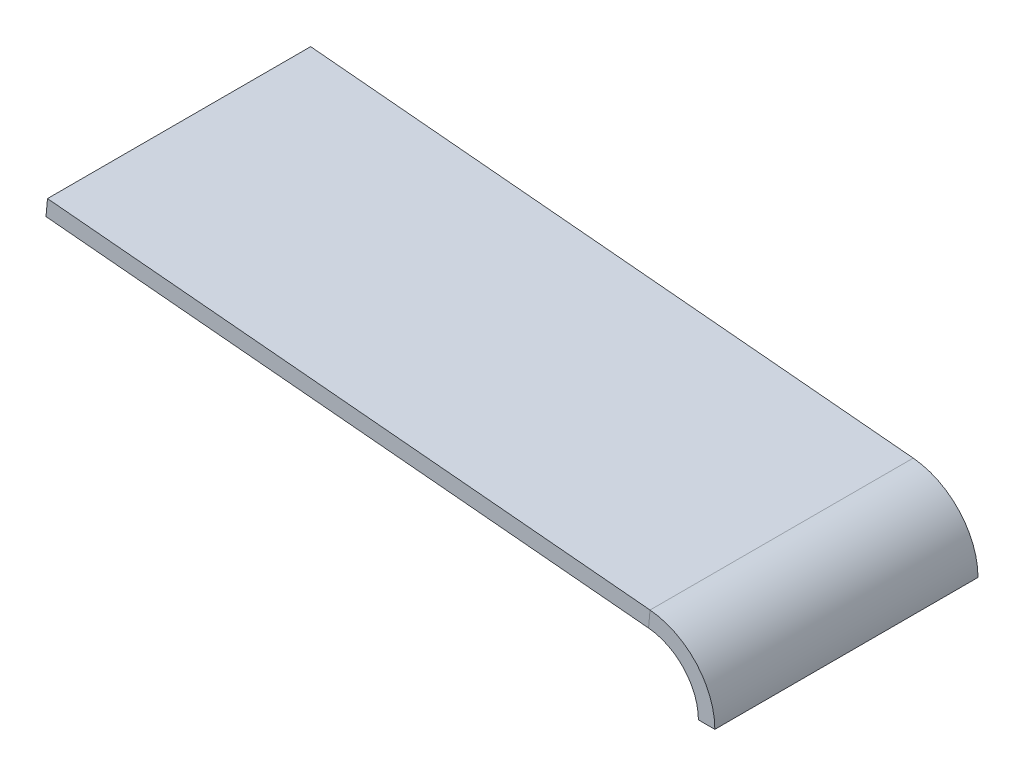
ISO-10303-21;
HEADER;
FILE_DESCRIPTION(('STEP AP214'),'2;1');
FILE_NAME('part.step','',(''),(''),'','','');
FILE_SCHEMA(('AUTOMOTIVE_DESIGN { 1 0 10303 214 1 1 1 1 }'));
ENDSEC;
DATA;
#1=APPLICATION_CONTEXT('core data for automotive mechanical design processes');
#2=APPLICATION_PROTOCOL_DEFINITION('international standard','automotive_design',2000,#1);
#3=PRODUCT_CONTEXT('',#1,'mechanical');
#4=PRODUCT('Part','Part','',(#3));
#5=PRODUCT_RELATED_PRODUCT_CATEGORY('part','',(#4));
#6=PRODUCT_DEFINITION_FORMATION('','',#4);
#7=PRODUCT_DEFINITION_CONTEXT('part definition',#1,'design');
#8=PRODUCT_DEFINITION('design','',#6,#7);
#9=PRODUCT_DEFINITION_SHAPE('','',#8);
#10=(LENGTH_UNIT() NAMED_UNIT(*) SI_UNIT(.MILLI.,.METRE.));
#11=(NAMED_UNIT(*) PLANE_ANGLE_UNIT() SI_UNIT($,.RADIAN.));
#12=(NAMED_UNIT(*) SI_UNIT($,.STERADIAN.) SOLID_ANGLE_UNIT());
#13=UNCERTAINTY_MEASURE_WITH_UNIT(LENGTH_MEASURE(1.E-05),#10,'distance_accuracy_value','');
#14=(GEOMETRIC_REPRESENTATION_CONTEXT(3) GLOBAL_UNCERTAINTY_ASSIGNED_CONTEXT((#13)) GLOBAL_UNIT_ASSIGNED_CONTEXT((#10,
#11,#12)) REPRESENTATION_CONTEXT('',''));
#15=CARTESIAN_POINT('',(0.,0.,0.));
#16=DIRECTION('',(0.,0.,1.));
#17=DIRECTION('',(1.,0.,0.));
#18=AXIS2_PLACEMENT_3D('',#15,#16,#17);
#19=CARTESIAN_POINT('',(3.31543524806376,2.89585211302469,-0.5));
#20=DIRECTION('',(0.,0.,1.));
#21=DIRECTION('',(1.,0.,0.));
#22=AXIS2_PLACEMENT_3D('',#19,#20,#21);
#23=PLANE('',#22);
#24=DIRECTION('',(0.0909866417901827,0.995852113024693,0.));
#25=VECTOR('',#24,1.);
#26=CARTESIAN_POINT('',(3.31543524806376,2.89585211302469,-0.5));
#27=LINE('',#26,#25);
#28=CARTESIAN_POINT('',(3.31543524806376,2.89585211302469,-0.5));
#29=VERTEX_POINT('',#28);
#30=CARTESIAN_POINT('',(3.34273124060081,3.1946077469321,-0.5));
#31=VERTEX_POINT('',#30);
#32=EDGE_CURVE('E11',#29,#31,#27,.T.);
#33=ORIENTED_EDGE('',*,*,#32,.F.);
#34=CARTESIAN_POINT('',(3.22444860627358,1.9,-0.5));
#35=DIRECTION('',(0.,0.,1.));
#36=DIRECTION('',(1.,0.,0.));
#37=AXIS2_PLACEMENT_3D('',#34,#35,#36);
#38=CIRCLE('',#37,1.);
#39=CARTESIAN_POINT('',(4.22444860627359,1.9,-0.5));
#40=VERTEX_POINT('',#39);
#41=EDGE_CURVE('E128',#40,#29,#38,.T.);
#42=ORIENTED_EDGE('',*,*,#41,.F.);
#43=DIRECTION('',(-1.,0.,0.));
#44=VECTOR('',#43,1.);
#45=CARTESIAN_POINT('',(4.52444860627359,1.9,-0.5));
#46=LINE('',#45,#44);
#47=CARTESIAN_POINT('',(4.52444860627359,1.9,-0.5));
#48=VERTEX_POINT('',#47);
#49=EDGE_CURVE('E131',#48,#40,#46,.T.);
#50=ORIENTED_EDGE('',*,*,#49,.F.);
#51=CARTESIAN_POINT('',(3.22444860627358,1.9,-0.5));
#52=DIRECTION('',(0.,0.,1.));
#53=DIRECTION('',(1.,0.,0.));
#54=AXIS2_PLACEMENT_3D('',#51,#52,#53);
#55=CIRCLE('',#54,1.3);
#56=EDGE_CURVE('E133',#48,#31,#55,.T.);
#57=ORIENTED_EDGE('',*,*,#56,.T.);
#58=EDGE_LOOP('',(#33,#42,#50,#57));
#59=FACE_BOUND('',#58,.T.);
#60=ADVANCED_FACE('F35',(#59),#23,.T.);
#61=CARTESIAN_POINT('',(3.34273124060081,3.1946077469321,-5.3));
#62=DIRECTION('',(0.,0.,-1.));
#63=DIRECTION('',(-1.,0.,0.));
#64=AXIS2_PLACEMENT_3D('',#61,#62,#63);
#65=PLANE('',#64);
#66=DIRECTION('',(-0.0909866417901827,-0.995852113024693,0.));
#67=VECTOR('',#66,1.);
#68=CARTESIAN_POINT('',(3.34273124060081,3.1946077469321,-5.3));
#69=LINE('',#68,#67);
#70=CARTESIAN_POINT('',(3.34273124060081,3.1946077469321,-5.3));
#71=VERTEX_POINT('',#70);
#72=CARTESIAN_POINT('',(3.31543524806376,2.89585211302469,-5.3));
#73=VERTEX_POINT('',#72);
#74=EDGE_CURVE('E42',#71,#73,#69,.T.);
#75=ORIENTED_EDGE('',*,*,#74,.F.);
#76=CARTESIAN_POINT('',(3.22444860627358,1.9,-5.3));
#77=DIRECTION('',(0.,0.,1.));
#78=DIRECTION('',(1.,0.,0.));
#79=AXIS2_PLACEMENT_3D('',#76,#77,#78);
#80=CIRCLE('',#79,1.3);
#81=CARTESIAN_POINT('',(4.52444860627359,1.9,-5.3));
#82=VERTEX_POINT('',#81);
#83=EDGE_CURVE('E120',#82,#71,#80,.T.);
#84=ORIENTED_EDGE('',*,*,#83,.F.);
#85=DIRECTION('',(-1.,0.,0.));
#86=VECTOR('',#85,1.);
#87=CARTESIAN_POINT('',(4.52444860627359,1.9,-5.3));
#88=LINE('',#87,#86);
#89=CARTESIAN_POINT('',(4.22444860627359,1.9,-5.3));
#90=VERTEX_POINT('',#89);
#91=EDGE_CURVE('E117',#82,#90,#88,.T.);
#92=ORIENTED_EDGE('',*,*,#91,.T.);
#93=CARTESIAN_POINT('',(3.22444860627358,1.9,-5.3));
#94=DIRECTION('',(0.,0.,1.));
#95=DIRECTION('',(1.,0.,0.));
#96=AXIS2_PLACEMENT_3D('',#93,#94,#95);
#97=CIRCLE('',#96,1.);
#98=EDGE_CURVE('E114',#90,#73,#97,.T.);
#99=ORIENTED_EDGE('',*,*,#98,.T.);
#100=EDGE_LOOP('',(#75,#84,#92,#99));
#101=FACE_BOUND('',#100,.T.);
#102=ADVANCED_FACE('F150',(#101),#65,.T.);
#103=CARTESIAN_POINT('',(-7.64770400746295,4.19875563390741,-0.5));
#104=DIRECTION('',(-0.0909866417901704,-0.995852113024694,0.));
#105=DIRECTION('',(0.995852113024694,-0.0909866417901704,0.));
#106=AXIS2_PLACEMENT_3D('',#103,#104,#105);
#107=PLANE('',#106);
#108=DIRECTION('',(0.,0.,-1.));
#109=VECTOR('',#108,1.);
#110=CARTESIAN_POINT('',(3.34273124060081,3.1946077469321,-0.5));
#111=LINE('',#110,#109);
#112=EDGE_CURVE('E110',#31,#71,#111,.T.);
#113=ORIENTED_EDGE('',*,*,#112,.T.);
#114=DIRECTION('',(-0.995852113024694,0.0909866417901704,0.));
#115=VECTOR('',#114,1.);
#116=CARTESIAN_POINT('',(-7.64770400746295,4.19875563390741,-5.3));
#117=LINE('',#116,#115);
#118=CARTESIAN_POINT('',(-7.64770400746295,4.19875563390741,-5.3));
#119=VERTEX_POINT('',#118);
#120=EDGE_CURVE('E102',#71,#119,#117,.T.);
#121=ORIENTED_EDGE('',*,*,#120,.T.);
#122=DIRECTION('',(0.,0.,-1.));
#123=VECTOR('',#122,1.);
#124=CARTESIAN_POINT('',(-7.64770400746295,4.19875563390741,-0.5));
#125=LINE('',#124,#123);
#126=CARTESIAN_POINT('',(-7.64770400746295,4.19875563390741,-0.5));
#127=VERTEX_POINT('',#126);
#128=EDGE_CURVE('E87',#127,#119,#125,.T.);
#129=ORIENTED_EDGE('',*,*,#128,.F.);
#130=DIRECTION('',(-0.995852113024694,0.0909866417901704,0.));
#131=VECTOR('',#130,1.);
#132=CARTESIAN_POINT('',(-7.64770400746295,4.19875563390741,-0.5));
#133=LINE('',#132,#131);
#134=EDGE_CURVE('E122',#31,#127,#133,.T.);
#135=ORIENTED_EDGE('',*,*,#134,.F.);
#136=EDGE_LOOP('',(#113,#121,#129,#135));
#137=FACE_BOUND('',#136,.T.);
#138=ADVANCED_FACE('F108',(#137),#107,.F.);
#139=CARTESIAN_POINT('',(-7.675,3.9,-0.5));
#140=DIRECTION('',(-0.995852113024694,0.0909866417901698,0.));
#141=DIRECTION('',(-0.0909866417901698,-0.995852113024694,0.));
#142=AXIS2_PLACEMENT_3D('',#139,#140,#141);
#143=PLANE('',#142);
#144=ORIENTED_EDGE('',*,*,#128,.T.);
#145=DIRECTION('',(0.0909866417901698,0.995852113024694,0.));
#146=VECTOR('',#145,1.);
#147=CARTESIAN_POINT('',(-7.675,3.9,-5.3));
#148=LINE('',#147,#146);
#149=CARTESIAN_POINT('',(-7.675,3.9,-5.3));
#150=VERTEX_POINT('',#149);
#151=EDGE_CURVE('E90',#150,#119,#148,.T.);
#152=ORIENTED_EDGE('',*,*,#151,.F.);
#153=DIRECTION('',(0.,0.,-1.));
#154=VECTOR('',#153,1.);
#155=CARTESIAN_POINT('',(-7.675,3.9,-0.5));
#156=LINE('',#155,#154);
#157=CARTESIAN_POINT('',(-7.675,3.9,-0.5));
#158=VERTEX_POINT('',#157);
#159=EDGE_CURVE('E96',#158,#150,#156,.T.);
#160=ORIENTED_EDGE('',*,*,#159,.F.);
#161=DIRECTION('',(0.0909866417901698,0.995852113024694,0.));
#162=VECTOR('',#161,1.);
#163=CARTESIAN_POINT('',(-7.675,3.9,-0.5));
#164=LINE('',#163,#162);
#165=EDGE_CURVE('E92',#158,#127,#164,.T.);
#166=ORIENTED_EDGE('',*,*,#165,.T.);
#167=EDGE_LOOP('',(#144,#152,#160,#166));
#168=FACE_BOUND('',#167,.T.);
#169=ADVANCED_FACE('F89',(#168),#143,.T.);
#170=CARTESIAN_POINT('',(-7.675,3.9,-0.5));
#171=DIRECTION('',(-0.0909866417901704,-0.995852113024694,0.));
#172=DIRECTION('',(0.995852113024694,-0.0909866417901704,0.));
#173=AXIS2_PLACEMENT_3D('',#170,#171,#172);
#174=PLANE('',#173);
#175=ORIENTED_EDGE('',*,*,#159,.T.);
#176=DIRECTION('',(-0.995852113024694,0.0909866417901704,0.));
#177=VECTOR('',#176,1.);
#178=CARTESIAN_POINT('',(-7.675,3.9,-5.3));
#179=LINE('',#178,#177);
#180=EDGE_CURVE('E105',#73,#150,#179,.T.);
#181=ORIENTED_EDGE('',*,*,#180,.F.);
#182=DIRECTION('',(0.,0.,-1.));
#183=VECTOR('',#182,1.);
#184=CARTESIAN_POINT('',(3.31543524806376,2.89585211302469,-0.5));
#185=LINE('',#184,#183);
#186=EDGE_CURVE('E139',#29,#73,#185,.T.);
#187=ORIENTED_EDGE('',*,*,#186,.F.);
#188=DIRECTION('',(-0.995852113024694,0.0909866417901704,0.));
#189=VECTOR('',#188,1.);
#190=CARTESIAN_POINT('',(-7.675,3.9,-0.5));
#191=LINE('',#190,#189);
#192=EDGE_CURVE('E125',#29,#158,#191,.T.);
#193=ORIENTED_EDGE('',*,*,#192,.T.);
#194=EDGE_LOOP('',(#175,#181,#187,#193));
#195=FACE_BOUND('',#194,.T.);
#196=ADVANCED_FACE('F151',(#195),#174,.T.);
#197=CARTESIAN_POINT('',(3.22444860627358,1.9,-0.5));
#198=DIRECTION('',(0.,0.,-1.));
#199=DIRECTION('',(-1.,0.,0.));
#200=AXIS2_PLACEMENT_3D('',#197,#198,#199);
#201=CYLINDRICAL_SURFACE('',#200,1.);
#202=ORIENTED_EDGE('',*,*,#186,.T.);
#203=ORIENTED_EDGE('',*,*,#98,.F.);
#204=DIRECTION('',(0.,0.,-1.));
#205=VECTOR('',#204,1.);
#206=CARTESIAN_POINT('',(4.22444860627359,1.9,-0.5));
#207=LINE('',#206,#205);
#208=EDGE_CURVE('E137',#40,#90,#207,.T.);
#209=ORIENTED_EDGE('',*,*,#208,.F.);
#210=ORIENTED_EDGE('',*,*,#41,.T.);
#211=EDGE_LOOP('',(#202,#203,#209,#210));
#212=FACE_BOUND('',#211,.T.);
#213=ADVANCED_FACE('F147',(#212),#201,.F.);
#214=CARTESIAN_POINT('',(4.52444860627359,1.9,-0.5));
#215=DIRECTION('',(0.,-1.,0.));
#216=DIRECTION('',(0.,0.,-1.));
#217=AXIS2_PLACEMENT_3D('',#214,#215,#216);
#218=PLANE('',#217);
#219=ORIENTED_EDGE('',*,*,#208,.T.);
#220=ORIENTED_EDGE('',*,*,#91,.F.);
#221=DIRECTION('',(0.,0.,-1.));
#222=VECTOR('',#221,1.);
#223=CARTESIAN_POINT('',(4.52444860627359,1.9,-0.5));
#224=LINE('',#223,#222);
#225=EDGE_CURVE('E55',#48,#82,#224,.T.);
#226=ORIENTED_EDGE('',*,*,#225,.F.);
#227=ORIENTED_EDGE('',*,*,#49,.T.);
#228=EDGE_LOOP('',(#219,#220,#226,#227));
#229=FACE_BOUND('',#228,.T.);
#230=ADVANCED_FACE('F161',(#229),#218,.T.);
#231=CARTESIAN_POINT('',(3.22444860627358,1.9,-0.5));
#232=DIRECTION('',(0.,0.,-1.));
#233=DIRECTION('',(-1.,0.,0.));
#234=AXIS2_PLACEMENT_3D('',#231,#232,#233);
#235=CYLINDRICAL_SURFACE('',#234,1.3);
#236=ORIENTED_EDGE('',*,*,#225,.T.);
#237=ORIENTED_EDGE('',*,*,#83,.T.);
#238=ORIENTED_EDGE('',*,*,#112,.F.);
#239=ORIENTED_EDGE('',*,*,#56,.F.);
#240=EDGE_LOOP('',(#236,#237,#238,#239));
#241=FACE_BOUND('',#240,.T.);
#242=ADVANCED_FACE('F154',(#241),#235,.T.);
#243=CARTESIAN_POINT('',(3.22444860627358,1.9,-0.5));
#244=DIRECTION('',(0.,0.,1.));
#245=DIRECTION('',(1.,0.,0.));
#246=AXIS2_PLACEMENT_3D('',#243,#244,#245);
#247=PLANE('',#246);
#248=ORIENTED_EDGE('',*,*,#134,.T.);
#249=ORIENTED_EDGE('',*,*,#165,.F.);
#250=ORIENTED_EDGE('',*,*,#192,.F.);
#251=ORIENTED_EDGE('',*,*,#32,.T.);
#252=EDGE_LOOP('',(#248,#249,#250,#251));
#253=FACE_BOUND('',#252,.T.);
#254=ADVANCED_FACE('F152',(#253),#247,.T.);
#255=CARTESIAN_POINT('',(3.22444860627358,1.9,-5.3));
#256=DIRECTION('',(0.,0.,1.));
#257=DIRECTION('',(1.,0.,0.));
#258=AXIS2_PLACEMENT_3D('',#255,#256,#257);
#259=PLANE('',#258);
#260=ORIENTED_EDGE('',*,*,#120,.F.);
#261=ORIENTED_EDGE('',*,*,#74,.T.);
#262=ORIENTED_EDGE('',*,*,#180,.T.);
#263=ORIENTED_EDGE('',*,*,#151,.T.);
#264=EDGE_LOOP('',(#260,#261,#262,#263));
#265=FACE_BOUND('',#264,.T.);
#266=ADVANCED_FACE('F101',(#265),#259,.F.);
#267=CLOSED_SHELL('',(#60,#102,#138,#169,#196,#213,#230,#242,#254,#266));
#268=MANIFOLD_SOLID_BREP('B2',#267);
#269=ADVANCED_BREP_SHAPE_REPRESENTATION('',(#18,#268),#14);
#270=SHAPE_DEFINITION_REPRESENTATION(#9,#269);
ENDSEC;
END-ISO-10303-21;
